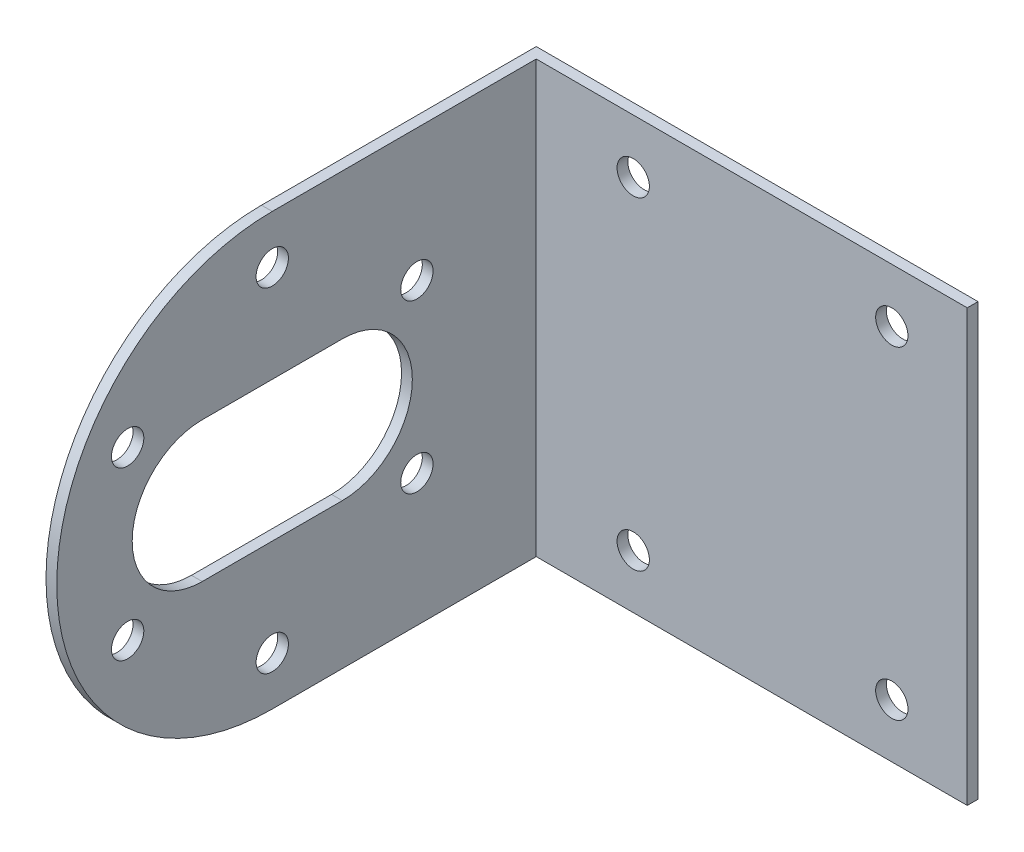
ISO-10303-21;
HEADER;
FILE_DESCRIPTION(('STEP AP214'),'2;1');
FILE_NAME('part.step','',(''),(''),'','','');
FILE_SCHEMA(('AUTOMOTIVE_DESIGN { 1 0 10303 214 1 1 1 1 }'));
ENDSEC;
DATA;
#1=APPLICATION_CONTEXT('core data for automotive mechanical design processes');
#2=APPLICATION_PROTOCOL_DEFINITION('international standard','automotive_design',2000,#1);
#3=PRODUCT_CONTEXT('',#1,'mechanical');
#4=PRODUCT('Part','Part','',(#3));
#5=PRODUCT_RELATED_PRODUCT_CATEGORY('part','',(#4));
#6=PRODUCT_DEFINITION_FORMATION('','',#4);
#7=PRODUCT_DEFINITION_CONTEXT('part definition',#1,'design');
#8=PRODUCT_DEFINITION('design','',#6,#7);
#9=PRODUCT_DEFINITION_SHAPE('','',#8);
#10=(LENGTH_UNIT() NAMED_UNIT(*) SI_UNIT(.MILLI.,.METRE.));
#11=(NAMED_UNIT(*) PLANE_ANGLE_UNIT() SI_UNIT($,.RADIAN.));
#12=(NAMED_UNIT(*) SI_UNIT($,.STERADIAN.) SOLID_ANGLE_UNIT());
#13=UNCERTAINTY_MEASURE_WITH_UNIT(LENGTH_MEASURE(1.E-05),#10,'distance_accuracy_value','');
#14=(GEOMETRIC_REPRESENTATION_CONTEXT(3) GLOBAL_UNCERTAINTY_ASSIGNED_CONTEXT((#13)) GLOBAL_UNIT_ASSIGNED_CONTEXT((#10,
#11,#12)) REPRESENTATION_CONTEXT('',''));
#15=CARTESIAN_POINT('',(0.,0.,0.));
#16=DIRECTION('',(0.,0.,1.));
#17=DIRECTION('',(1.,0.,0.));
#18=AXIS2_PLACEMENT_3D('',#15,#16,#17);
#19=CARTESIAN_POINT('',(0.,6.5,18.));
#20=DIRECTION('',(0.,-1.,0.));
#21=DIRECTION('',(0.,0.,-1.));
#22=AXIS2_PLACEMENT_3D('',#19,#20,#21);
#23=PLANE('',#22);
#24=DIRECTION('',(0.,0.,1.));
#25=VECTOR('',#24,1.);
#26=CARTESIAN_POINT('',(1.,6.5,0.));
#27=LINE('',#26,#25);
#28=CARTESIAN_POINT('',(1.,6.5,18.));
#29=VERTEX_POINT('',#28);
#30=CARTESIAN_POINT('',(1.,6.5,31.));
#31=VERTEX_POINT('',#30);
#32=EDGE_CURVE('E214',#29,#31,#27,.T.);
#33=ORIENTED_EDGE('',*,*,#32,.T.);
#34=DIRECTION('',(-1.,0.,0.));
#35=VECTOR('',#34,1.);
#36=CARTESIAN_POINT('',(0.,6.5,31.));
#37=LINE('',#36,#35);
#38=CARTESIAN_POINT('',(0.,6.5,31.));
#39=VERTEX_POINT('',#38);
#40=EDGE_CURVE('E109',#31,#39,#37,.T.);
#41=ORIENTED_EDGE('',*,*,#40,.T.);
#42=DIRECTION('',(0.,0.,-1.));
#43=VECTOR('',#42,1.);
#44=CARTESIAN_POINT('',(0.,6.5,0.));
#45=LINE('',#44,#43);
#46=CARTESIAN_POINT('',(0.,6.5,18.));
#47=VERTEX_POINT('',#46);
#48=EDGE_CURVE('E200',#39,#47,#45,.T.);
#49=ORIENTED_EDGE('',*,*,#48,.T.);
#50=DIRECTION('',(-1.,0.,0.));
#51=VECTOR('',#50,1.);
#52=CARTESIAN_POINT('',(0.,6.5,18.));
#53=LINE('',#52,#51);
#54=EDGE_CURVE('E132',#47,#29,#53,.F.);
#55=ORIENTED_EDGE('',*,*,#54,.T.);
#56=EDGE_LOOP('',(#33,#41,#49,#55));
#57=FACE_BOUND('',#56,.T.);
#58=ADVANCED_FACE('F17',(#57),#23,.T.);
#59=CARTESIAN_POINT('',(0.,7.75,37.923393758659));
#60=DIRECTION('',(-1.,0.,0.));
#61=DIRECTION('',(0.,0.,1.));
#62=AXIS2_PLACEMENT_3D('',#59,#60,#61);
#63=CYLINDRICAL_SURFACE('',#62,1.5);
#64=CARTESIAN_POINT('',(1.,7.75,37.923393758659));
#65=DIRECTION('',(-1.,0.,0.));
#66=DIRECTION('',(0.,0.,1.));
#67=AXIS2_PLACEMENT_3D('',#64,#65,#66);
#68=CIRCLE('',#67,1.5);
#69=CARTESIAN_POINT('',(1.,7.75,39.423393758659));
#70=VERTEX_POINT('',#69);
#71=EDGE_CURVE('E218',#70,#70,#68,.F.);
#72=ORIENTED_EDGE('',*,*,#71,.T.);
#73=EDGE_LOOP('',(#72));
#74=FACE_BOUND('',#73,.T.);
#75=CARTESIAN_POINT('',(0.,7.75,37.923393758659));
#76=DIRECTION('',(-1.,0.,0.));
#77=DIRECTION('',(0.,0.,1.));
#78=AXIS2_PLACEMENT_3D('',#75,#76,#77);
#79=CIRCLE('',#78,1.5);
#80=CARTESIAN_POINT('',(0.,7.75,39.423393758659));
#81=VERTEX_POINT('',#80);
#82=EDGE_CURVE('E197',#81,#81,#79,.T.);
#83=ORIENTED_EDGE('',*,*,#82,.T.);
#84=EDGE_LOOP('',(#83));
#85=FACE_BOUND('',#84,.T.);
#86=ADVANCED_FACE('F345',(#74,#85),#63,.F.);
#87=CARTESIAN_POINT('',(0.,15.5,24.5));
#88=DIRECTION('',(-1.,0.,0.));
#89=DIRECTION('',(0.,0.,1.));
#90=AXIS2_PLACEMENT_3D('',#87,#88,#89);
#91=CYLINDRICAL_SURFACE('',#90,1.5);
#92=CARTESIAN_POINT('',(1.,15.5,24.5));
#93=DIRECTION('',(-1.,0.,0.));
#94=DIRECTION('',(0.,0.,1.));
#95=AXIS2_PLACEMENT_3D('',#92,#93,#94);
#96=CIRCLE('',#95,1.5);
#97=CARTESIAN_POINT('',(1.,15.5,26.));
#98=VERTEX_POINT('',#97);
#99=EDGE_CURVE('E204',#98,#98,#96,.F.);
#100=ORIENTED_EDGE('',*,*,#99,.T.);
#101=EDGE_LOOP('',(#100));
#102=FACE_BOUND('',#101,.T.);
#103=CARTESIAN_POINT('',(0.,15.5,24.5));
#104=DIRECTION('',(-1.,0.,0.));
#105=DIRECTION('',(0.,0.,1.));
#106=AXIS2_PLACEMENT_3D('',#103,#104,#105);
#107=CIRCLE('',#106,1.5);
#108=CARTESIAN_POINT('',(0.,15.5,26.));
#109=VERTEX_POINT('',#108);
#110=EDGE_CURVE('E194',#109,#109,#107,.T.);
#111=ORIENTED_EDGE('',*,*,#110,.T.);
#112=EDGE_LOOP('',(#111));
#113=FACE_BOUND('',#112,.T.);
#114=ADVANCED_FACE('F342',(#102,#113),#91,.F.);
#115=CARTESIAN_POINT('',(0.,7.75,11.076606241341));
#116=DIRECTION('',(-1.,0.,0.));
#117=DIRECTION('',(0.,0.,1.));
#118=AXIS2_PLACEMENT_3D('',#115,#116,#117);
#119=CYLINDRICAL_SURFACE('',#118,1.5);
#120=CARTESIAN_POINT('',(1.,7.75,11.076606241341));
#121=DIRECTION('',(-1.,0.,0.));
#122=DIRECTION('',(0.,0.,1.));
#123=AXIS2_PLACEMENT_3D('',#120,#121,#122);
#124=CIRCLE('',#123,1.5);
#125=CARTESIAN_POINT('',(1.,7.75,12.576606241341));
#126=VERTEX_POINT('',#125);
#127=EDGE_CURVE('E201',#126,#126,#124,.F.);
#128=ORIENTED_EDGE('',*,*,#127,.T.);
#129=EDGE_LOOP('',(#128));
#130=FACE_BOUND('',#129,.T.);
#131=CARTESIAN_POINT('',(0.,7.75,11.076606241341));
#132=DIRECTION('',(-1.,0.,0.));
#133=DIRECTION('',(0.,0.,1.));
#134=AXIS2_PLACEMENT_3D('',#131,#132,#133);
#135=CIRCLE('',#134,1.5);
#136=CARTESIAN_POINT('',(0.,7.75,12.576606241341));
#137=VERTEX_POINT('',#136);
#138=EDGE_CURVE('E191',#137,#137,#135,.T.);
#139=ORIENTED_EDGE('',*,*,#138,.T.);
#140=EDGE_LOOP('',(#139));
#141=FACE_BOUND('',#140,.T.);
#142=ADVANCED_FACE('F338',(#130,#141),#119,.F.);
#143=CARTESIAN_POINT('',(0.,0.,18.));
#144=DIRECTION('',(-1.,0.,0.));
#145=DIRECTION('',(0.,0.,1.));
#146=AXIS2_PLACEMENT_3D('',#143,#144,#145);
#147=CYLINDRICAL_SURFACE('',#146,6.5);
#148=DIRECTION('',(1.,0.,0.));
#149=VECTOR('',#148,1.);
#150=CARTESIAN_POINT('',(0.,-6.5,18.));
#151=LINE('',#150,#149);
#152=CARTESIAN_POINT('',(0.,-6.5,18.));
#153=VERTEX_POINT('',#152);
#154=CARTESIAN_POINT('',(1.,-6.5,18.));
#155=VERTEX_POINT('',#154);
#156=EDGE_CURVE('E129',#153,#155,#151,.T.);
#157=ORIENTED_EDGE('',*,*,#156,.T.);
#158=CARTESIAN_POINT('',(1.,0.,18.));
#159=DIRECTION('',(-1.,0.,0.));
#160=DIRECTION('',(0.,0.,1.));
#161=AXIS2_PLACEMENT_3D('',#158,#159,#160);
#162=CIRCLE('',#161,6.5);
#163=EDGE_CURVE('E215',#155,#29,#162,.F.);
#164=ORIENTED_EDGE('',*,*,#163,.T.);
#165=ORIENTED_EDGE('',*,*,#54,.F.);
#166=CARTESIAN_POINT('',(0.,0.,18.));
#167=DIRECTION('',(-1.,0.,0.));
#168=DIRECTION('',(0.,0.,1.));
#169=AXIS2_PLACEMENT_3D('',#166,#167,#168);
#170=CIRCLE('',#169,6.5);
#171=EDGE_CURVE('E188',#47,#153,#170,.T.);
#172=ORIENTED_EDGE('',*,*,#171,.T.);
#173=EDGE_LOOP('',(#157,#164,#165,#172));
#174=FACE_BOUND('',#173,.T.);
#175=ADVANCED_FACE('F334',(#174),#147,.F.);
#176=CARTESIAN_POINT('',(0.,-6.5,18.));
#177=DIRECTION('',(0.,-1.,0.));
#178=DIRECTION('',(0.,0.,-1.));
#179=AXIS2_PLACEMENT_3D('',#176,#177,#178);
#180=PLANE('',#179);
#181=DIRECTION('',(0.,0.,1.));
#182=VECTOR('',#181,1.);
#183=CARTESIAN_POINT('',(1.,-6.5,0.));
#184=LINE('',#183,#182);
#185=CARTESIAN_POINT('',(1.,-6.5,31.));
#186=VERTEX_POINT('',#185);
#187=EDGE_CURVE('E210',#186,#155,#184,.F.);
#188=ORIENTED_EDGE('',*,*,#187,.T.);
#189=ORIENTED_EDGE('',*,*,#156,.F.);
#190=DIRECTION('',(0.,0.,-1.));
#191=VECTOR('',#190,1.);
#192=CARTESIAN_POINT('',(0.,-6.5,0.));
#193=LINE('',#192,#191);
#194=CARTESIAN_POINT('',(0.,-6.5,31.));
#195=VERTEX_POINT('',#194);
#196=EDGE_CURVE('E187',#153,#195,#193,.F.);
#197=ORIENTED_EDGE('',*,*,#196,.T.);
#198=DIRECTION('',(-1.,0.,0.));
#199=VECTOR('',#198,1.);
#200=CARTESIAN_POINT('',(0.,-6.5,31.));
#201=LINE('',#200,#199);
#202=EDGE_CURVE('E127',#195,#186,#201,.F.);
#203=ORIENTED_EDGE('',*,*,#202,.T.);
#204=EDGE_LOOP('',(#188,#189,#197,#203));
#205=FACE_BOUND('',#204,.T.);
#206=ADVANCED_FACE('F330',(#205),#180,.F.);
#207=CARTESIAN_POINT('',(0.,0.,31.));
#208=DIRECTION('',(-1.,0.,0.));
#209=DIRECTION('',(0.,0.,1.));
#210=AXIS2_PLACEMENT_3D('',#207,#208,#209);
#211=CYLINDRICAL_SURFACE('',#210,6.5);
#212=ORIENTED_EDGE('',*,*,#40,.F.);
#213=CARTESIAN_POINT('',(1.,0.,31.));
#214=DIRECTION('',(-1.,0.,0.));
#215=DIRECTION('',(0.,0.,1.));
#216=AXIS2_PLACEMENT_3D('',#213,#214,#215);
#217=CIRCLE('',#216,6.5);
#218=EDGE_CURVE('E211',#31,#186,#217,.F.);
#219=ORIENTED_EDGE('',*,*,#218,.T.);
#220=ORIENTED_EDGE('',*,*,#202,.F.);
#221=CARTESIAN_POINT('',(0.,0.,31.));
#222=DIRECTION('',(-1.,0.,0.));
#223=DIRECTION('',(0.,0.,1.));
#224=AXIS2_PLACEMENT_3D('',#221,#222,#223);
#225=CIRCLE('',#224,6.5);
#226=EDGE_CURVE('E185',#195,#39,#225,.T.);
#227=ORIENTED_EDGE('',*,*,#226,.T.);
#228=EDGE_LOOP('',(#212,#219,#220,#227));
#229=FACE_BOUND('',#228,.T.);
#230=ADVANCED_FACE('F327',(#229),#211,.F.);
#231=CARTESIAN_POINT('',(0.,0.,24.5));
#232=DIRECTION('',(-1.,0.,0.));
#233=DIRECTION('',(0.,0.,1.));
#234=AXIS2_PLACEMENT_3D('',#231,#232,#233);
#235=CYLINDRICAL_SURFACE('',#234,20.);
#236=DIRECTION('',(1.,0.,0.));
#237=VECTOR('',#236,1.);
#238=CARTESIAN_POINT('',(0.,-20.,24.5));
#239=LINE('',#238,#237);
#240=CARTESIAN_POINT('',(0.,-20.,24.5));
#241=VERTEX_POINT('',#240);
#242=CARTESIAN_POINT('',(1.,-20.,24.5));
#243=VERTEX_POINT('',#242);
#244=EDGE_CURVE('E104',#241,#243,#239,.T.);
#245=ORIENTED_EDGE('',*,*,#244,.T.);
#246=CARTESIAN_POINT('',(1.,0.,24.5));
#247=DIRECTION('',(-1.,0.,0.));
#248=DIRECTION('',(0.,0.,1.));
#249=AXIS2_PLACEMENT_3D('',#246,#247,#248);
#250=CIRCLE('',#249,20.);
#251=CARTESIAN_POINT('',(1.,19.9999999999995,24.5));
#252=VERTEX_POINT('',#251);
#253=EDGE_CURVE('E20',#243,#252,#250,.T.);
#254=ORIENTED_EDGE('',*,*,#253,.T.);
#255=DIRECTION('',(-1.,0.,0.));
#256=VECTOR('',#255,1.);
#257=CARTESIAN_POINT('',(0.,20.,24.5));
#258=LINE('',#257,#256);
#259=CARTESIAN_POINT('',(0.,20.0000000000005,24.5));
#260=VERTEX_POINT('',#259);
#261=EDGE_CURVE('E89',#252,#260,#258,.T.);
#262=ORIENTED_EDGE('',*,*,#261,.T.);
#263=CARTESIAN_POINT('',(0.,0.,24.5));
#264=DIRECTION('',(-1.,0.,0.));
#265=DIRECTION('',(0.,0.,1.));
#266=AXIS2_PLACEMENT_3D('',#263,#264,#265);
#267=CIRCLE('',#266,20.);
#268=EDGE_CURVE('E106',#260,#241,#267,.F.);
#269=ORIENTED_EDGE('',*,*,#268,.T.);
#270=EDGE_LOOP('',(#245,#254,#262,#269));
#271=FACE_BOUND('',#270,.T.);
#272=ADVANCED_FACE('F105',(#271),#235,.T.);
#273=CARTESIAN_POINT('',(0.,-7.75,37.923393758659));
#274=DIRECTION('',(-1.,0.,0.));
#275=DIRECTION('',(0.,0.,1.));
#276=AXIS2_PLACEMENT_3D('',#273,#274,#275);
#277=CYLINDRICAL_SURFACE('',#276,1.5);
#278=CARTESIAN_POINT('',(1.,-7.75,37.923393758659));
#279=DIRECTION('',(-1.,0.,0.));
#280=DIRECTION('',(0.,0.,1.));
#281=AXIS2_PLACEMENT_3D('',#278,#279,#280);
#282=CIRCLE('',#281,1.5);
#283=CARTESIAN_POINT('',(1.,-7.75,39.423393758659));
#284=VERTEX_POINT('',#283);
#285=EDGE_CURVE('E223',#284,#284,#282,.F.);
#286=ORIENTED_EDGE('',*,*,#285,.T.);
#287=EDGE_LOOP('',(#286));
#288=FACE_BOUND('',#287,.T.);
#289=CARTESIAN_POINT('',(0.,-7.75,37.923393758659));
#290=DIRECTION('',(-1.,0.,0.));
#291=DIRECTION('',(0.,0.,1.));
#292=AXIS2_PLACEMENT_3D('',#289,#290,#291);
#293=CIRCLE('',#292,1.5);
#294=CARTESIAN_POINT('',(0.,-7.75,39.423393758659));
#295=VERTEX_POINT('',#294);
#296=EDGE_CURVE('E181',#295,#295,#293,.T.);
#297=ORIENTED_EDGE('',*,*,#296,.T.);
#298=EDGE_LOOP('',(#297));
#299=FACE_BOUND('',#298,.T.);
#300=ADVANCED_FACE('F321',(#288,#299),#277,.F.);
#301=CARTESIAN_POINT('',(0.,-15.5,24.5));
#302=DIRECTION('',(-1.,0.,0.));
#303=DIRECTION('',(0.,0.,1.));
#304=AXIS2_PLACEMENT_3D('',#301,#302,#303);
#305=CYLINDRICAL_SURFACE('',#304,1.5);
#306=CARTESIAN_POINT('',(1.,-15.5,24.5));
#307=DIRECTION('',(-1.,0.,0.));
#308=DIRECTION('',(0.,0.,1.));
#309=AXIS2_PLACEMENT_3D('',#306,#307,#308);
#310=CIRCLE('',#309,1.5);
#311=CARTESIAN_POINT('',(1.,-15.5,26.));
#312=VERTEX_POINT('',#311);
#313=EDGE_CURVE('E221',#312,#312,#310,.F.);
#314=ORIENTED_EDGE('',*,*,#313,.T.);
#315=EDGE_LOOP('',(#314));
#316=FACE_BOUND('',#315,.T.);
#317=CARTESIAN_POINT('',(0.,-15.5,24.5));
#318=DIRECTION('',(-1.,0.,0.));
#319=DIRECTION('',(0.,0.,1.));
#320=AXIS2_PLACEMENT_3D('',#317,#318,#319);
#321=CIRCLE('',#320,1.5);
#322=CARTESIAN_POINT('',(0.,-15.5,26.));
#323=VERTEX_POINT('',#322);
#324=EDGE_CURVE('E178',#323,#323,#321,.T.);
#325=ORIENTED_EDGE('',*,*,#324,.T.);
#326=EDGE_LOOP('',(#325));
#327=FACE_BOUND('',#326,.T.);
#328=ADVANCED_FACE('F317',(#316,#327),#305,.F.);
#329=CARTESIAN_POINT('',(0.,-7.75,11.076606241341));
#330=DIRECTION('',(-1.,0.,0.));
#331=DIRECTION('',(0.,0.,1.));
#332=AXIS2_PLACEMENT_3D('',#329,#330,#331);
#333=CYLINDRICAL_SURFACE('',#332,1.5);
#334=CARTESIAN_POINT('',(1.,-7.75,11.076606241341));
#335=DIRECTION('',(-1.,0.,0.));
#336=DIRECTION('',(0.,0.,1.));
#337=AXIS2_PLACEMENT_3D('',#334,#335,#336);
#338=CIRCLE('',#337,1.5);
#339=CARTESIAN_POINT('',(1.,-7.75,12.576606241341));
#340=VERTEX_POINT('',#339);
#341=EDGE_CURVE('E207',#340,#340,#338,.F.);
#342=ORIENTED_EDGE('',*,*,#341,.T.);
#343=EDGE_LOOP('',(#342));
#344=FACE_BOUND('',#343,.T.);
#345=CARTESIAN_POINT('',(0.,-7.75,11.076606241341));
#346=DIRECTION('',(-1.,0.,0.));
#347=DIRECTION('',(0.,0.,1.));
#348=AXIS2_PLACEMENT_3D('',#345,#346,#347);
#349=CIRCLE('',#348,1.5);
#350=CARTESIAN_POINT('',(0.,-7.75,12.576606241341));
#351=VERTEX_POINT('',#350);
#352=EDGE_CURVE('E143',#351,#351,#349,.T.);
#353=ORIENTED_EDGE('',*,*,#352,.T.);
#354=EDGE_LOOP('',(#353));
#355=FACE_BOUND('',#354,.T.);
#356=ADVANCED_FACE('F310',(#344,#355),#333,.F.);
#357=CARTESIAN_POINT('',(1.,-20.,0.));
#358=DIRECTION('',(-1.,0.,0.));
#359=DIRECTION('',(0.,0.,1.));
#360=AXIS2_PLACEMENT_3D('',#357,#358,#359);
#361=PLANE('',#360);
#362=ORIENTED_EDGE('',*,*,#127,.F.);
#363=EDGE_LOOP('',(#362));
#364=FACE_BOUND('',#363,.T.);
#365=ORIENTED_EDGE('',*,*,#99,.F.);
#366=EDGE_LOOP('',(#365));
#367=FACE_BOUND('',#366,.T.);
#368=ORIENTED_EDGE('',*,*,#341,.F.);
#369=EDGE_LOOP('',(#368));
#370=FACE_BOUND('',#369,.T.);
#371=ORIENTED_EDGE('',*,*,#218,.F.);
#372=ORIENTED_EDGE('',*,*,#32,.F.);
#373=ORIENTED_EDGE('',*,*,#163,.F.);
#374=ORIENTED_EDGE('',*,*,#187,.F.);
#375=EDGE_LOOP('',(#371,#372,#373,#374));
#376=FACE_BOUND('',#375,.T.);
#377=ORIENTED_EDGE('',*,*,#71,.F.);
#378=EDGE_LOOP('',(#377));
#379=FACE_BOUND('',#378,.T.);
#380=ORIENTED_EDGE('',*,*,#313,.F.);
#381=EDGE_LOOP('',(#380));
#382=FACE_BOUND('',#381,.T.);
#383=ORIENTED_EDGE('',*,*,#285,.F.);
#384=EDGE_LOOP('',(#383));
#385=FACE_BOUND('',#384,.T.);
#386=ORIENTED_EDGE('',*,*,#253,.F.);
#387=DIRECTION('',(0.,0.,1.));
#388=VECTOR('',#387,1.);
#389=CARTESIAN_POINT('',(1.,-20.,0.));
#390=LINE('',#389,#388);
#391=CARTESIAN_POINT('',(1.,-19.9999999999969,0.));
#392=VERTEX_POINT('',#391);
#393=EDGE_CURVE('E98',#392,#243,#390,.T.);
#394=ORIENTED_EDGE('',*,*,#393,.F.);
#395=DIRECTION('',(0.,1.,0.));
#396=VECTOR('',#395,1.);
#397=CARTESIAN_POINT('',(1.,4.64783E-12,0.));
#398=LINE('',#397,#396);
#399=CARTESIAN_POINT('',(1.,20.0000000000007,0.));
#400=VERTEX_POINT('',#399);
#401=EDGE_CURVE('E141',#400,#392,#398,.F.);
#402=ORIENTED_EDGE('',*,*,#401,.F.);
#403=DIRECTION('',(0.,0.,1.));
#404=VECTOR('',#403,1.);
#405=CARTESIAN_POINT('',(1.,19.999999999999,0.));
#406=LINE('',#405,#404);
#407=EDGE_CURVE('E100',#252,#400,#406,.F.);
#408=ORIENTED_EDGE('',*,*,#407,.F.);
#409=EDGE_LOOP('',(#386,#394,#402,#408));
#410=FACE_BOUND('',#409,.T.);
#411=ADVANCED_FACE('F95',(#364,#367,#370,#376,#379,#382,#385,#410),#361,.F.);
#412=CARTESIAN_POINT('',(20.5,4.64783E-12,0.));
#413=DIRECTION('',(0.,0.,1.));
#414=DIRECTION('',(1.,0.,0.));
#415=AXIS2_PLACEMENT_3D('',#412,#413,#414);
#416=PLANE('',#415);
#417=CARTESIAN_POINT('',(34.,15.000000000005,0.));
#418=DIRECTION('',(0.,0.,1.));
#419=DIRECTION('',(1.,0.,0.));
#420=AXIS2_PLACEMENT_3D('',#417,#418,#419);
#421=CIRCLE('',#420,1.5);
#422=CARTESIAN_POINT('',(35.5,15.000000000005,0.));
#423=VERTEX_POINT('',#422);
#424=EDGE_CURVE('E164',#423,#423,#421,.F.);
#425=ORIENTED_EDGE('',*,*,#424,.T.);
#426=EDGE_LOOP('',(#425));
#427=FACE_BOUND('',#426,.T.);
#428=CARTESIAN_POINT('',(10.,15.000000000005,0.));
#429=DIRECTION('',(0.,0.,1.));
#430=DIRECTION('',(1.,0.,0.));
#431=AXIS2_PLACEMENT_3D('',#428,#429,#430);
#432=CIRCLE('',#431,1.5);
#433=CARTESIAN_POINT('',(11.5,15.000000000005,0.));
#434=VERTEX_POINT('',#433);
#435=EDGE_CURVE('E171',#434,#434,#432,.F.);
#436=ORIENTED_EDGE('',*,*,#435,.T.);
#437=EDGE_LOOP('',(#436));
#438=FACE_BOUND('',#437,.T.);
#439=CARTESIAN_POINT('',(34.,-14.99999999999,0.));
#440=DIRECTION('',(0.,0.,1.));
#441=DIRECTION('',(1.,0.,0.));
#442=AXIS2_PLACEMENT_3D('',#439,#440,#441);
#443=CIRCLE('',#442,1.5);
#444=CARTESIAN_POINT('',(35.5,-14.99999999999,0.));
#445=VERTEX_POINT('',#444);
#446=EDGE_CURVE('E168',#445,#445,#443,.F.);
#447=ORIENTED_EDGE('',*,*,#446,.T.);
#448=EDGE_LOOP('',(#447));
#449=FACE_BOUND('',#448,.T.);
#450=CARTESIAN_POINT('',(10.,-14.99999999999,0.));
#451=DIRECTION('',(0.,0.,1.));
#452=DIRECTION('',(1.,0.,0.));
#453=AXIS2_PLACEMENT_3D('',#450,#451,#452);
#454=CIRCLE('',#453,1.5);
#455=CARTESIAN_POINT('',(11.5,-14.99999999999,0.));
#456=VERTEX_POINT('',#455);
#457=EDGE_CURVE('E124',#456,#456,#454,.F.);
#458=ORIENTED_EDGE('',*,*,#457,.T.);
#459=EDGE_LOOP('',(#458));
#460=FACE_BOUND('',#459,.T.);
#461=DIRECTION('',(0.,1.,0.));
#462=VECTOR('',#461,1.);
#463=CARTESIAN_POINT('',(41.,-19.99999999999,0.));
#464=LINE('',#463,#462);
#465=CARTESIAN_POINT('',(41.,20.000000000005,0.));
#466=VERTEX_POINT('',#465);
#467=CARTESIAN_POINT('',(41.,-19.9999999999925,0.));
#468=VERTEX_POINT('',#467);
#469=EDGE_CURVE('E237',#466,#468,#464,.F.);
#470=ORIENTED_EDGE('',*,*,#469,.F.);
#471=DIRECTION('',(1.,0.,0.));
#472=VECTOR('',#471,1.);
#473=CARTESIAN_POINT('',(41.,20.000000000005,0.));
#474=LINE('',#473,#472);
#475=EDGE_CURVE('E138',#400,#466,#474,.T.);
#476=ORIENTED_EDGE('',*,*,#475,.F.);
#477=ORIENTED_EDGE('',*,*,#401,.T.);
#478=DIRECTION('',(1.,0.,0.));
#479=VECTOR('',#478,1.);
#480=CARTESIAN_POINT('',(0.,-19.99999999999,0.));
#481=LINE('',#480,#479);
#482=EDGE_CURVE('E114',#468,#392,#481,.F.);
#483=ORIENTED_EDGE('',*,*,#482,.F.);
#484=EDGE_LOOP('',(#470,#476,#477,#483));
#485=FACE_BOUND('',#484,.T.);
#486=ADVANCED_FACE('F261',(#427,#438,#449,#460,#485),#416,.T.);
#487=CARTESIAN_POINT('',(0.,-19.99999999999,0.));
#488=DIRECTION('',(0.,-1.,0.));
#489=DIRECTION('',(0.,0.,-1.));
#490=AXIS2_PLACEMENT_3D('',#487,#488,#489);
#491=PLANE('',#490);
#492=ORIENTED_EDGE('',*,*,#482,.T.);
#493=ORIENTED_EDGE('',*,*,#393,.T.);
#494=ORIENTED_EDGE('',*,*,#244,.F.);
#495=DIRECTION('',(0.,0.,1.));
#496=VECTOR('',#495,1.);
#497=CARTESIAN_POINT('',(0.,-19.99999999999,0.));
#498=LINE('',#497,#496);
#499=CARTESIAN_POINT('',(0.,-19.99999999999,-1.));
#500=VERTEX_POINT('',#499);
#501=EDGE_CURVE('E122',#500,#241,#498,.T.);
#502=ORIENTED_EDGE('',*,*,#501,.F.);
#503=DIRECTION('',(1.,0.,0.));
#504=VECTOR('',#503,1.);
#505=CARTESIAN_POINT('',(20.5,-19.99999999999,-1.));
#506=LINE('',#505,#504);
#507=CARTESIAN_POINT('',(41.,-19.99999999999,-1.));
#508=VERTEX_POINT('',#507);
#509=EDGE_CURVE('E167',#500,#508,#506,.T.);
#510=ORIENTED_EDGE('',*,*,#509,.T.);
#511=DIRECTION('',(0.,0.,-1.));
#512=VECTOR('',#511,1.);
#513=CARTESIAN_POINT('',(41.,-19.99999999999,0.));
#514=LINE('',#513,#512);
#515=EDGE_CURVE('E152',#468,#508,#514,.T.);
#516=ORIENTED_EDGE('',*,*,#515,.F.);
#517=EDGE_LOOP('',(#492,#493,#494,#502,#510,#516));
#518=FACE_BOUND('',#517,.T.);
#519=ADVANCED_FACE('F112',(#518),#491,.T.);
#520=CARTESIAN_POINT('',(41.,-19.99999999999,0.));
#521=DIRECTION('',(1.,0.,0.));
#522=DIRECTION('',(0.,0.,-1.));
#523=AXIS2_PLACEMENT_3D('',#520,#521,#522);
#524=PLANE('',#523);
#525=DIRECTION('',(0.,0.,1.));
#526=VECTOR('',#525,1.);
#527=CARTESIAN_POINT('',(41.,20.000000000005,0.));
#528=LINE('',#527,#526);
#529=CARTESIAN_POINT('',(41.,20.000000000005,-1.));
#530=VERTEX_POINT('',#529);
#531=EDGE_CURVE('E148',#466,#530,#528,.F.);
#532=ORIENTED_EDGE('',*,*,#531,.F.);
#533=ORIENTED_EDGE('',*,*,#469,.T.);
#534=ORIENTED_EDGE('',*,*,#515,.T.);
#535=DIRECTION('',(0.,1.,0.));
#536=VECTOR('',#535,1.);
#537=CARTESIAN_POINT('',(41.,4.64783E-12,-1.));
#538=LINE('',#537,#536);
#539=EDGE_CURVE('E243',#508,#530,#538,.T.);
#540=ORIENTED_EDGE('',*,*,#539,.T.);
#541=EDGE_LOOP('',(#532,#533,#534,#540));
#542=FACE_BOUND('',#541,.T.);
#543=ADVANCED_FACE('F258',(#542),#524,.T.);
#544=CARTESIAN_POINT('',(41.,20.000000000005,0.));
#545=DIRECTION('',(0.,1.,0.));
#546=DIRECTION('',(0.,0.,1.));
#547=AXIS2_PLACEMENT_3D('',#544,#545,#546);
#548=PLANE('',#547);
#549=DIRECTION('',(0.,0.,1.));
#550=VECTOR('',#549,1.);
#551=CARTESIAN_POINT('',(0.,20.000000000001,0.));
#552=LINE('',#551,#550);
#553=CARTESIAN_POINT('',(0.,20.000000000004,-1.));
#554=VERTEX_POINT('',#553);
#555=EDGE_CURVE('E35',#260,#554,#552,.F.);
#556=ORIENTED_EDGE('',*,*,#555,.F.);
#557=ORIENTED_EDGE('',*,*,#261,.F.);
#558=ORIENTED_EDGE('',*,*,#407,.T.);
#559=ORIENTED_EDGE('',*,*,#475,.T.);
#560=ORIENTED_EDGE('',*,*,#531,.T.);
#561=DIRECTION('',(1.,0.,0.));
#562=VECTOR('',#561,1.);
#563=CARTESIAN_POINT('',(20.5,20.000000000005,-1.));
#564=LINE('',#563,#562);
#565=EDGE_CURVE('E246',#530,#554,#564,.F.);
#566=ORIENTED_EDGE('',*,*,#565,.T.);
#567=EDGE_LOOP('',(#556,#557,#558,#559,#560,#566));
#568=FACE_BOUND('',#567,.T.);
#569=ADVANCED_FACE('F262',(#568),#548,.T.);
#570=CARTESIAN_POINT('',(0.,0.,0.));
#571=DIRECTION('',(-1.,0.,0.));
#572=DIRECTION('',(0.,0.,1.));
#573=AXIS2_PLACEMENT_3D('',#570,#571,#572);
#574=PLANE('',#573);
#575=ORIENTED_EDGE('',*,*,#171,.F.);
#576=ORIENTED_EDGE('',*,*,#48,.F.);
#577=ORIENTED_EDGE('',*,*,#226,.F.);
#578=ORIENTED_EDGE('',*,*,#196,.F.);
#579=EDGE_LOOP('',(#575,#576,#577,#578));
#580=FACE_BOUND('',#579,.T.);
#581=ORIENTED_EDGE('',*,*,#268,.F.);
#582=ORIENTED_EDGE('',*,*,#555,.T.);
#583=DIRECTION('',(0.,1.,0.));
#584=VECTOR('',#583,1.);
#585=CARTESIAN_POINT('',(0.,4.64783E-12,-1.));
#586=LINE('',#585,#584);
#587=EDGE_CURVE('E163',#554,#500,#586,.F.);
#588=ORIENTED_EDGE('',*,*,#587,.T.);
#589=ORIENTED_EDGE('',*,*,#501,.T.);
#590=EDGE_LOOP('',(#581,#582,#588,#589));
#591=FACE_BOUND('',#590,.T.);
#592=ORIENTED_EDGE('',*,*,#352,.F.);
#593=EDGE_LOOP('',(#592));
#594=FACE_BOUND('',#593,.T.);
#595=ORIENTED_EDGE('',*,*,#324,.F.);
#596=EDGE_LOOP('',(#595));
#597=FACE_BOUND('',#596,.T.);
#598=ORIENTED_EDGE('',*,*,#296,.F.);
#599=EDGE_LOOP('',(#598));
#600=FACE_BOUND('',#599,.T.);
#601=ORIENTED_EDGE('',*,*,#138,.F.);
#602=EDGE_LOOP('',(#601));
#603=FACE_BOUND('',#602,.T.);
#604=ORIENTED_EDGE('',*,*,#110,.F.);
#605=EDGE_LOOP('',(#604));
#606=FACE_BOUND('',#605,.T.);
#607=ORIENTED_EDGE('',*,*,#82,.F.);
#608=EDGE_LOOP('',(#607));
#609=FACE_BOUND('',#608,.T.);
#610=ADVANCED_FACE('F250',(#580,#591,#594,#597,#600,#603,#606,#609),#574,.T.);
#611=CARTESIAN_POINT('',(10.,-14.99999999999,0.));
#612=DIRECTION('',(0.,0.,1.));
#613=DIRECTION('',(1.,0.,0.));
#614=AXIS2_PLACEMENT_3D('',#611,#612,#613);
#615=CYLINDRICAL_SURFACE('',#614,1.5);
#616=CARTESIAN_POINT('',(10.,-14.99999999999,-1.));
#617=DIRECTION('',(0.,0.,1.));
#618=DIRECTION('',(1.,0.,0.));
#619=AXIS2_PLACEMENT_3D('',#616,#617,#618);
#620=CIRCLE('',#619,1.5);
#621=CARTESIAN_POINT('',(11.5,-14.99999999999,-1.));
#622=VERTEX_POINT('',#621);
#623=EDGE_CURVE('E160',#622,#622,#620,.F.);
#624=ORIENTED_EDGE('',*,*,#623,.T.);
#625=EDGE_LOOP('',(#624));
#626=FACE_BOUND('',#625,.T.);
#627=ORIENTED_EDGE('',*,*,#457,.F.);
#628=EDGE_LOOP('',(#627));
#629=FACE_BOUND('',#628,.T.);
#630=ADVANCED_FACE('F270',(#626,#629),#615,.F.);
#631=CARTESIAN_POINT('',(10.,15.000000000005,0.));
#632=DIRECTION('',(0.,0.,1.));
#633=DIRECTION('',(1.,0.,0.));
#634=AXIS2_PLACEMENT_3D('',#631,#632,#633);
#635=CYLINDRICAL_SURFACE('',#634,1.5);
#636=CARTESIAN_POINT('',(10.,15.000000000005,-1.));
#637=DIRECTION('',(0.,0.,1.));
#638=DIRECTION('',(1.,0.,0.));
#639=AXIS2_PLACEMENT_3D('',#636,#637,#638);
#640=CIRCLE('',#639,1.5);
#641=CARTESIAN_POINT('',(11.5,15.000000000005,-1.));
#642=VERTEX_POINT('',#641);
#643=EDGE_CURVE('E157',#642,#642,#640,.F.);
#644=ORIENTED_EDGE('',*,*,#643,.T.);
#645=EDGE_LOOP('',(#644));
#646=FACE_BOUND('',#645,.T.);
#647=ORIENTED_EDGE('',*,*,#435,.F.);
#648=EDGE_LOOP('',(#647));
#649=FACE_BOUND('',#648,.T.);
#650=ADVANCED_FACE('F289',(#646,#649),#635,.F.);
#651=CARTESIAN_POINT('',(34.,-14.99999999999,0.));
#652=DIRECTION('',(0.,0.,1.));
#653=DIRECTION('',(1.,0.,0.));
#654=AXIS2_PLACEMENT_3D('',#651,#652,#653);
#655=CYLINDRICAL_SURFACE('',#654,1.5);
#656=CARTESIAN_POINT('',(34.,-14.99999999999,-1.));
#657=DIRECTION('',(0.,0.,1.));
#658=DIRECTION('',(1.,0.,0.));
#659=AXIS2_PLACEMENT_3D('',#656,#657,#658);
#660=CIRCLE('',#659,1.5);
#661=CARTESIAN_POINT('',(35.5,-14.99999999999,-1.));
#662=VERTEX_POINT('',#661);
#663=EDGE_CURVE('E26',#662,#662,#660,.F.);
#664=ORIENTED_EDGE('',*,*,#663,.T.);
#665=EDGE_LOOP('',(#664));
#666=FACE_BOUND('',#665,.T.);
#667=ORIENTED_EDGE('',*,*,#446,.F.);
#668=EDGE_LOOP('',(#667));
#669=FACE_BOUND('',#668,.T.);
#670=ADVANCED_FACE('F281',(#666,#669),#655,.F.);
#671=CARTESIAN_POINT('',(34.,15.000000000005,0.));
#672=DIRECTION('',(0.,0.,1.));
#673=DIRECTION('',(1.,0.,0.));
#674=AXIS2_PLACEMENT_3D('',#671,#672,#673);
#675=CYLINDRICAL_SURFACE('',#674,1.5);
#676=CARTESIAN_POINT('',(34.,15.000000000005,-1.));
#677=DIRECTION('',(0.,0.,1.));
#678=DIRECTION('',(1.,0.,0.));
#679=AXIS2_PLACEMENT_3D('',#676,#677,#678);
#680=CIRCLE('',#679,1.5);
#681=CARTESIAN_POINT('',(35.5,15.000000000005,-1.));
#682=VERTEX_POINT('',#681);
#683=EDGE_CURVE('E11',#682,#682,#680,.F.);
#684=ORIENTED_EDGE('',*,*,#683,.T.);
#685=EDGE_LOOP('',(#684));
#686=FACE_BOUND('',#685,.T.);
#687=ORIENTED_EDGE('',*,*,#424,.F.);
#688=EDGE_LOOP('',(#687));
#689=FACE_BOUND('',#688,.T.);
#690=ADVANCED_FACE('F275',(#686,#689),#675,.F.);
#691=CARTESIAN_POINT('',(20.5,4.64783E-12,-1.));
#692=DIRECTION('',(0.,0.,1.));
#693=DIRECTION('',(1.,0.,0.));
#694=AXIS2_PLACEMENT_3D('',#691,#692,#693);
#695=PLANE('',#694);
#696=ORIENTED_EDGE('',*,*,#683,.F.);
#697=EDGE_LOOP('',(#696));
#698=FACE_BOUND('',#697,.T.);
#699=ORIENTED_EDGE('',*,*,#663,.F.);
#700=EDGE_LOOP('',(#699));
#701=FACE_BOUND('',#700,.T.);
#702=ORIENTED_EDGE('',*,*,#643,.F.);
#703=EDGE_LOOP('',(#702));
#704=FACE_BOUND('',#703,.T.);
#705=ORIENTED_EDGE('',*,*,#623,.F.);
#706=EDGE_LOOP('',(#705));
#707=FACE_BOUND('',#706,.T.);
#708=ORIENTED_EDGE('',*,*,#587,.F.);
#709=ORIENTED_EDGE('',*,*,#565,.F.);
#710=ORIENTED_EDGE('',*,*,#539,.F.);
#711=ORIENTED_EDGE('',*,*,#509,.F.);
#712=EDGE_LOOP('',(#708,#709,#710,#711));
#713=FACE_BOUND('',#712,.T.);
#714=ADVANCED_FACE('F255',(#698,#701,#704,#707,#713),#695,.F.);
#715=CLOSED_SHELL('',(#58,#86,#114,#142,#175,#206,#230,#272,#300,#328,#356,#411,#486,#519,#543,
#569,#610,#630,#650,#670,#690,#714));
#716=MANIFOLD_SOLID_BREP('B1',#715);
#717=ADVANCED_BREP_SHAPE_REPRESENTATION('',(#18,#716),#14);
#718=SHAPE_DEFINITION_REPRESENTATION(#9,#717);
ENDSEC;
END-ISO-10303-21;
